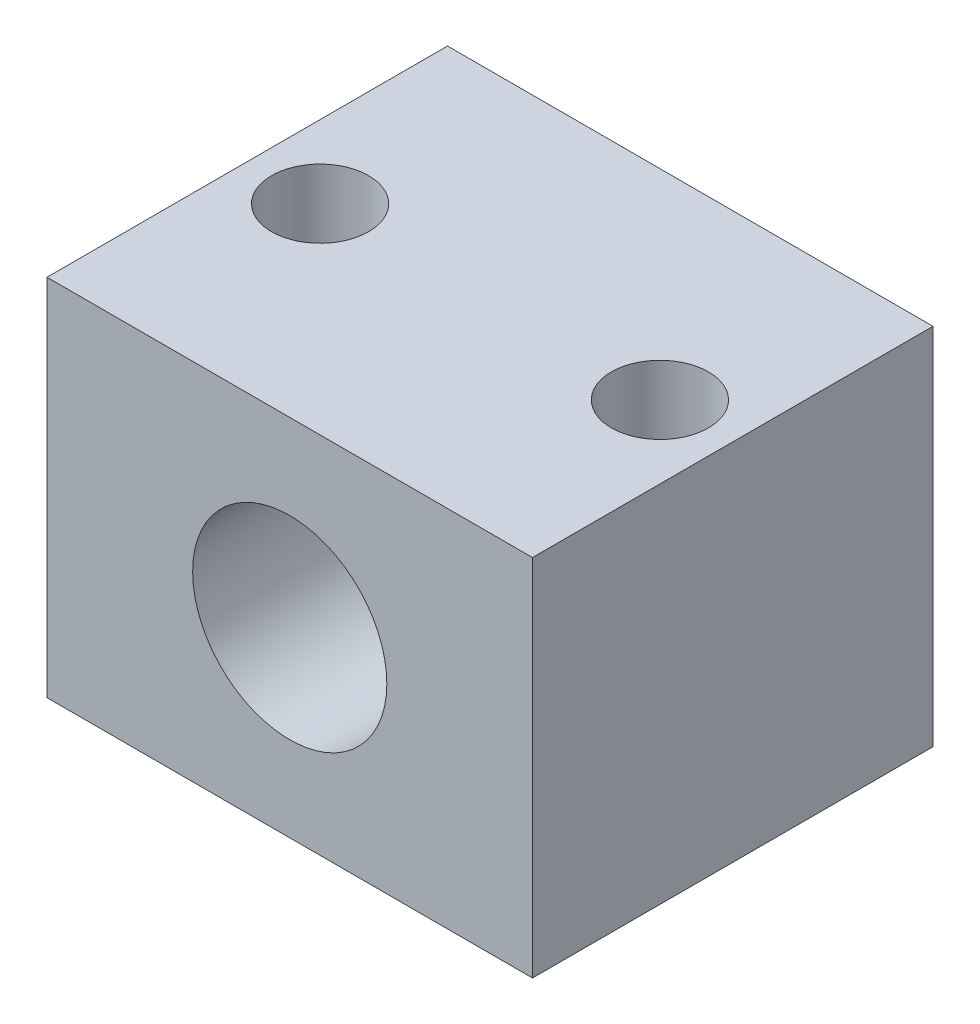
ISO-10303-21;
HEADER;
FILE_DESCRIPTION(('STEP AP214'),'2;1');
FILE_NAME('part.step','',(''),(''),'','','');
FILE_SCHEMA(('AUTOMOTIVE_DESIGN { 1 0 10303 214 1 1 1 1 }'));
ENDSEC;
DATA;
#1=APPLICATION_CONTEXT('core data for automotive mechanical design processes');
#2=APPLICATION_PROTOCOL_DEFINITION('international standard','automotive_design',2000,#1);
#3=PRODUCT_CONTEXT('',#1,'mechanical');
#4=PRODUCT('Part','Part','',(#3));
#5=PRODUCT_RELATED_PRODUCT_CATEGORY('part','',(#4));
#6=PRODUCT_DEFINITION_FORMATION('','',#4);
#7=PRODUCT_DEFINITION_CONTEXT('part definition',#1,'design');
#8=PRODUCT_DEFINITION('design','',#6,#7);
#9=PRODUCT_DEFINITION_SHAPE('','',#8);
#10=(LENGTH_UNIT() NAMED_UNIT(*) SI_UNIT(.MILLI.,.METRE.));
#11=(NAMED_UNIT(*) PLANE_ANGLE_UNIT() SI_UNIT($,.RADIAN.));
#12=(NAMED_UNIT(*) SI_UNIT($,.STERADIAN.) SOLID_ANGLE_UNIT());
#13=UNCERTAINTY_MEASURE_WITH_UNIT(LENGTH_MEASURE(1.E-05),#10,'distance_accuracy_value','');
#14=(GEOMETRIC_REPRESENTATION_CONTEXT(3) GLOBAL_UNCERTAINTY_ASSIGNED_CONTEXT((#13)) GLOBAL_UNIT_ASSIGNED_CONTEXT((#10,
#11,#12)) REPRESENTATION_CONTEXT('',''));
#15=CARTESIAN_POINT('',(0.,0.,0.));
#16=DIRECTION('',(0.,0.,1.));
#17=DIRECTION('',(1.,0.,0.));
#18=AXIS2_PLACEMENT_3D('',#15,#16,#17);
#19=CARTESIAN_POINT('',(-20.,0.,16.5));
#20=DIRECTION('',(0.,0.,1.));
#21=DIRECTION('',(1.,0.,0.));
#22=AXIS2_PLACEMENT_3D('',#19,#20,#21);
#23=PLANE('',#22);
#24=DIRECTION('',(-1.,0.,0.));
#25=VECTOR('',#24,1.);
#26=CARTESIAN_POINT('',(0.,0.,16.5));
#27=LINE('',#26,#25);
#28=CARTESIAN_POINT('',(0.,0.,16.5));
#29=VERTEX_POINT('',#28);
#30=CARTESIAN_POINT('',(-20.,0.,16.5));
#31=VERTEX_POINT('',#30);
#32=EDGE_CURVE('E82',#29,#31,#27,.T.);
#33=ORIENTED_EDGE('',*,*,#32,.T.);
#34=DIRECTION('',(0.,-1.,0.));
#35=VECTOR('',#34,1.);
#36=CARTESIAN_POINT('',(-20.,0.,16.5));
#37=LINE('',#36,#35);
#38=CARTESIAN_POINT('',(-20.,-15.,16.5));
#39=VERTEX_POINT('',#38);
#40=EDGE_CURVE('E77',#31,#39,#37,.T.);
#41=ORIENTED_EDGE('',*,*,#40,.T.);
#42=DIRECTION('',(1.,0.,0.));
#43=VECTOR('',#42,1.);
#44=CARTESIAN_POINT('',(-20.,-15.,16.5));
#45=LINE('',#44,#43);
#46=CARTESIAN_POINT('',(0.,-15.,16.5));
#47=VERTEX_POINT('',#46);
#48=EDGE_CURVE('E80',#39,#47,#45,.T.);
#49=ORIENTED_EDGE('',*,*,#48,.T.);
#50=DIRECTION('',(0.,1.,0.));
#51=VECTOR('',#50,1.);
#52=CARTESIAN_POINT('',(0.,-15.,16.5));
#53=LINE('',#52,#51);
#54=EDGE_CURVE('E47',#47,#29,#53,.T.);
#55=ORIENTED_EDGE('',*,*,#54,.T.);
#56=EDGE_LOOP('',(#33,#41,#49,#55));
#57=FACE_BOUND('',#56,.T.);
#58=CARTESIAN_POINT('',(-10.,-7.5,16.5));
#59=DIRECTION('',(0.,0.,1.));
#60=DIRECTION('',(1.,0.,0.));
#61=AXIS2_PLACEMENT_3D('',#58,#59,#60);
#62=CIRCLE('',#61,4.);
#63=CARTESIAN_POINT('',(-6.,-7.5,16.5));
#64=VERTEX_POINT('',#63);
#65=EDGE_CURVE('E97',#64,#64,#62,.T.);
#66=ORIENTED_EDGE('',*,*,#65,.F.);
#67=EDGE_LOOP('',(#66));
#68=FACE_BOUND('',#67,.T.);
#69=ADVANCED_FACE('F30',(#57,#68),#23,.T.);
#70=CARTESIAN_POINT('',(-20.,0.,0.));
#71=DIRECTION('',(0.,0.,1.));
#72=DIRECTION('',(1.,0.,0.));
#73=AXIS2_PLACEMENT_3D('',#70,#71,#72);
#74=PLANE('',#73);
#75=DIRECTION('',(-1.,0.,0.));
#76=VECTOR('',#75,1.);
#77=CARTESIAN_POINT('',(0.,0.,0.));
#78=LINE('',#77,#76);
#79=CARTESIAN_POINT('',(0.,0.,0.));
#80=VERTEX_POINT('',#79);
#81=CARTESIAN_POINT('',(-20.,0.,0.));
#82=VERTEX_POINT('',#81);
#83=EDGE_CURVE('E94',#80,#82,#78,.T.);
#84=ORIENTED_EDGE('',*,*,#83,.F.);
#85=DIRECTION('',(0.,1.,0.));
#86=VECTOR('',#85,1.);
#87=CARTESIAN_POINT('',(0.,-15.,0.));
#88=LINE('',#87,#86);
#89=CARTESIAN_POINT('',(0.,-15.,0.));
#90=VERTEX_POINT('',#89);
#91=EDGE_CURVE('E70',#90,#80,#88,.T.);
#92=ORIENTED_EDGE('',*,*,#91,.F.);
#93=DIRECTION('',(1.,0.,0.));
#94=VECTOR('',#93,1.);
#95=CARTESIAN_POINT('',(-20.,-15.,0.));
#96=LINE('',#95,#94);
#97=CARTESIAN_POINT('',(-20.,-15.,0.));
#98=VERTEX_POINT('',#97);
#99=EDGE_CURVE('E64',#98,#90,#96,.T.);
#100=ORIENTED_EDGE('',*,*,#99,.F.);
#101=DIRECTION('',(0.,-1.,0.));
#102=VECTOR('',#101,1.);
#103=CARTESIAN_POINT('',(-20.,0.,0.));
#104=LINE('',#103,#102);
#105=EDGE_CURVE('E86',#82,#98,#104,.T.);
#106=ORIENTED_EDGE('',*,*,#105,.F.);
#107=EDGE_LOOP('',(#84,#92,#100,#106));
#108=FACE_BOUND('',#107,.T.);
#109=CARTESIAN_POINT('',(-10.,-7.5,0.));
#110=DIRECTION('',(0.,0.,1.));
#111=DIRECTION('',(1.,0.,0.));
#112=AXIS2_PLACEMENT_3D('',#109,#110,#111);
#113=CIRCLE('',#112,4.);
#114=CARTESIAN_POINT('',(-6.,-7.5,0.));
#115=VERTEX_POINT('',#114);
#116=EDGE_CURVE('E109',#115,#115,#113,.T.);
#117=ORIENTED_EDGE('',*,*,#116,.T.);
#118=EDGE_LOOP('',(#117));
#119=FACE_BOUND('',#118,.T.);
#120=ADVANCED_FACE('F105',(#108,#119),#74,.F.);
#121=CARTESIAN_POINT('',(0.,0.,16.5));
#122=DIRECTION('',(0.,-1.,0.));
#123=DIRECTION('',(1.,0.,0.));
#124=AXIS2_PLACEMENT_3D('',#121,#122,#123);
#125=PLANE('',#124);
#126=CARTESIAN_POINT('',(-3.,0.,8.25));
#127=DIRECTION('',(0.,1.,0.));
#128=DIRECTION('',(-1.,0.,0.));
#129=AXIS2_PLACEMENT_3D('',#126,#127,#128);
#130=CIRCLE('',#129,2.);
#131=CARTESIAN_POINT('',(-5.,0.,8.25));
#132=VERTEX_POINT('',#131);
#133=EDGE_CURVE('E121',#132,#132,#130,.T.);
#134=ORIENTED_EDGE('',*,*,#133,.F.);
#135=EDGE_LOOP('',(#134));
#136=FACE_BOUND('',#135,.T.);
#137=CARTESIAN_POINT('',(-17.,0.,8.25));
#138=DIRECTION('',(0.,1.,0.));
#139=DIRECTION('',(1.,0.,0.));
#140=AXIS2_PLACEMENT_3D('',#137,#138,#139);
#141=CIRCLE('',#140,2.);
#142=CARTESIAN_POINT('',(-15.,0.,8.25));
#143=VERTEX_POINT('',#142);
#144=EDGE_CURVE('E115',#143,#143,#141,.T.);
#145=ORIENTED_EDGE('',*,*,#144,.F.);
#146=EDGE_LOOP('',(#145));
#147=FACE_BOUND('',#146,.T.);
#148=ORIENTED_EDGE('',*,*,#83,.T.);
#149=DIRECTION('',(0.,0.,-1.));
#150=VECTOR('',#149,1.);
#151=CARTESIAN_POINT('',(-20.,0.,16.5));
#152=LINE('',#151,#150);
#153=EDGE_CURVE('E11',#31,#82,#152,.T.);
#154=ORIENTED_EDGE('',*,*,#153,.F.);
#155=ORIENTED_EDGE('',*,*,#32,.F.);
#156=DIRECTION('',(0.,0.,-1.));
#157=VECTOR('',#156,1.);
#158=CARTESIAN_POINT('',(0.,0.,16.5));
#159=LINE('',#158,#157);
#160=EDGE_CURVE('E90',#29,#80,#159,.T.);
#161=ORIENTED_EDGE('',*,*,#160,.T.);
#162=EDGE_LOOP('',(#148,#154,#155,#161));
#163=FACE_BOUND('',#162,.T.);
#164=ADVANCED_FACE('F32',(#136,#147,#163),#125,.F.);
#165=CARTESIAN_POINT('',(-20.,0.,16.5));
#166=DIRECTION('',(1.,0.,0.));
#167=DIRECTION('',(0.,1.,0.));
#168=AXIS2_PLACEMENT_3D('',#165,#166,#167);
#169=PLANE('',#168);
#170=ORIENTED_EDGE('',*,*,#105,.T.);
#171=DIRECTION('',(0.,0.,-1.));
#172=VECTOR('',#171,1.);
#173=CARTESIAN_POINT('',(-20.,-15.,16.5));
#174=LINE('',#173,#172);
#175=EDGE_CURVE('E39',#39,#98,#174,.T.);
#176=ORIENTED_EDGE('',*,*,#175,.F.);
#177=ORIENTED_EDGE('',*,*,#40,.F.);
#178=ORIENTED_EDGE('',*,*,#153,.T.);
#179=EDGE_LOOP('',(#170,#176,#177,#178));
#180=FACE_BOUND('',#179,.T.);
#181=ADVANCED_FACE('F85',(#180),#169,.F.);
#182=CARTESIAN_POINT('',(-20.,-15.,16.5));
#183=DIRECTION('',(0.,1.,0.));
#184=DIRECTION('',(0.,0.,1.));
#185=AXIS2_PLACEMENT_3D('',#182,#183,#184);
#186=PLANE('',#185);
#187=CARTESIAN_POINT('',(-3.,-15.,8.25));
#188=DIRECTION('',(0.,1.,0.));
#189=DIRECTION('',(-1.,0.,0.));
#190=AXIS2_PLACEMENT_3D('',#187,#188,#189);
#191=CIRCLE('',#190,2.);
#192=CARTESIAN_POINT('',(-5.,-15.,8.25));
#193=VERTEX_POINT('',#192);
#194=EDGE_CURVE('E118',#193,#193,#191,.T.);
#195=ORIENTED_EDGE('',*,*,#194,.T.);
#196=EDGE_LOOP('',(#195));
#197=FACE_BOUND('',#196,.T.);
#198=CARTESIAN_POINT('',(-17.,-15.,8.25));
#199=DIRECTION('',(0.,1.,0.));
#200=DIRECTION('',(1.,0.,0.));
#201=AXIS2_PLACEMENT_3D('',#198,#199,#200);
#202=CIRCLE('',#201,2.);
#203=CARTESIAN_POINT('',(-15.,-15.,8.25));
#204=VERTEX_POINT('',#203);
#205=EDGE_CURVE('E112',#204,#204,#202,.T.);
#206=ORIENTED_EDGE('',*,*,#205,.T.);
#207=EDGE_LOOP('',(#206));
#208=FACE_BOUND('',#207,.T.);
#209=ORIENTED_EDGE('',*,*,#99,.T.);
#210=DIRECTION('',(0.,0.,-1.));
#211=VECTOR('',#210,1.);
#212=CARTESIAN_POINT('',(0.,-15.,16.5));
#213=LINE('',#212,#211);
#214=EDGE_CURVE('E87',#47,#90,#213,.T.);
#215=ORIENTED_EDGE('',*,*,#214,.F.);
#216=ORIENTED_EDGE('',*,*,#48,.F.);
#217=ORIENTED_EDGE('',*,*,#175,.T.);
#218=EDGE_LOOP('',(#209,#215,#216,#217));
#219=FACE_BOUND('',#218,.T.);
#220=ADVANCED_FACE('F88',(#197,#208,#219),#186,.F.);
#221=CARTESIAN_POINT('',(0.,-15.,16.5));
#222=DIRECTION('',(-1.,0.,0.));
#223=DIRECTION('',(0.,0.,1.));
#224=AXIS2_PLACEMENT_3D('',#221,#222,#223);
#225=PLANE('',#224);
#226=ORIENTED_EDGE('',*,*,#91,.T.);
#227=ORIENTED_EDGE('',*,*,#160,.F.);
#228=ORIENTED_EDGE('',*,*,#54,.F.);
#229=ORIENTED_EDGE('',*,*,#214,.T.);
#230=EDGE_LOOP('',(#226,#227,#228,#229));
#231=FACE_BOUND('',#230,.T.);
#232=ADVANCED_FACE('F102',(#231),#225,.F.);
#233=CARTESIAN_POINT('',(-10.,-7.5,16.5));
#234=DIRECTION('',(0.,0.,-1.));
#235=DIRECTION('',(-1.,0.,0.));
#236=AXIS2_PLACEMENT_3D('',#233,#234,#235);
#237=CYLINDRICAL_SURFACE('',#236,4.);
#238=ORIENTED_EDGE('',*,*,#65,.T.);
#239=EDGE_LOOP('',(#238));
#240=FACE_BOUND('',#239,.T.);
#241=ORIENTED_EDGE('',*,*,#116,.F.);
#242=EDGE_LOOP('',(#241));
#243=FACE_BOUND('',#242,.T.);
#244=ADVANCED_FACE('F141',(#240,#243),#237,.F.);
#245=CARTESIAN_POINT('',(-17.,-15.,8.25));
#246=DIRECTION('',(0.,1.,0.));
#247=DIRECTION('',(-1.,0.,0.));
#248=AXIS2_PLACEMENT_3D('',#245,#246,#247);
#249=CYLINDRICAL_SURFACE('',#248,2.);
#250=ORIENTED_EDGE('',*,*,#205,.F.);
#251=EDGE_LOOP('',(#250));
#252=FACE_BOUND('',#251,.T.);
#253=ORIENTED_EDGE('',*,*,#144,.T.);
#254=EDGE_LOOP('',(#253));
#255=FACE_BOUND('',#254,.T.);
#256=ADVANCED_FACE('F132',(#252,#255),#249,.F.);
#257=CARTESIAN_POINT('',(-3.,-15.,8.25));
#258=DIRECTION('',(0.,1.,0.));
#259=DIRECTION('',(-1.,0.,0.));
#260=AXIS2_PLACEMENT_3D('',#257,#258,#259);
#261=CYLINDRICAL_SURFACE('',#260,2.);
#262=ORIENTED_EDGE('',*,*,#194,.F.);
#263=EDGE_LOOP('',(#262));
#264=FACE_BOUND('',#263,.T.);
#265=ORIENTED_EDGE('',*,*,#133,.T.);
#266=EDGE_LOOP('',(#265));
#267=FACE_BOUND('',#266,.T.);
#268=ADVANCED_FACE('F129',(#264,#267),#261,.F.);
#269=CLOSED_SHELL('',(#69,#120,#164,#181,#220,#232,#244,#256,#268));
#270=MANIFOLD_SOLID_BREP('B2',#269);
#271=ADVANCED_BREP_SHAPE_REPRESENTATION('',(#18,#270),#14);
#272=SHAPE_DEFINITION_REPRESENTATION(#9,#271);
ENDSEC;
END-ISO-10303-21;
